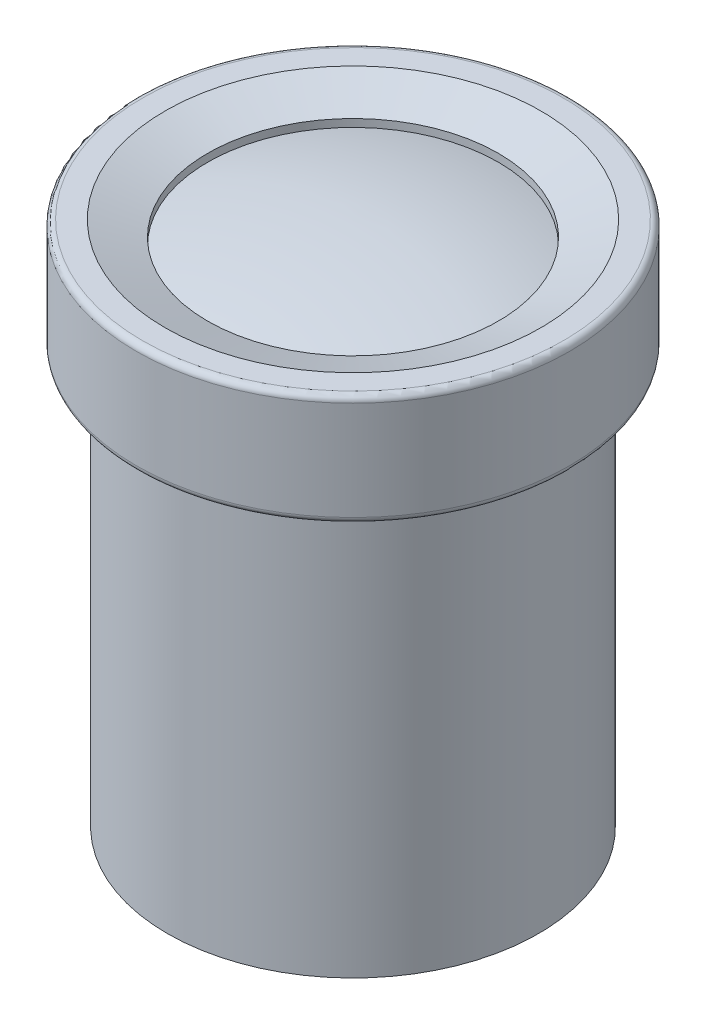
ISO-10303-21;
HEADER;
FILE_DESCRIPTION(('STEP AP214'),'2;1');
FILE_NAME('part.step','',(''),(''),'','','');
FILE_SCHEMA(('AUTOMOTIVE_DESIGN { 1 0 10303 214 1 1 1 1 }'));
ENDSEC;
DATA;
#1=APPLICATION_CONTEXT('core data for automotive mechanical design processes');
#2=APPLICATION_PROTOCOL_DEFINITION('international standard','automotive_design',2000,#1);
#3=PRODUCT_CONTEXT('',#1,'mechanical');
#4=PRODUCT('Part','Part','',(#3));
#5=PRODUCT_RELATED_PRODUCT_CATEGORY('part','',(#4));
#6=PRODUCT_DEFINITION_FORMATION('','',#4);
#7=PRODUCT_DEFINITION_CONTEXT('part definition',#1,'design');
#8=PRODUCT_DEFINITION('design','',#6,#7);
#9=PRODUCT_DEFINITION_SHAPE('','',#8);
#10=(LENGTH_UNIT() NAMED_UNIT(*) SI_UNIT(.MILLI.,.METRE.));
#11=(NAMED_UNIT(*) PLANE_ANGLE_UNIT() SI_UNIT($,.RADIAN.));
#12=(NAMED_UNIT(*) SI_UNIT($,.STERADIAN.) SOLID_ANGLE_UNIT());
#13=UNCERTAINTY_MEASURE_WITH_UNIT(LENGTH_MEASURE(1.E-05),#10,'distance_accuracy_value','');
#14=(GEOMETRIC_REPRESENTATION_CONTEXT(3) GLOBAL_UNCERTAINTY_ASSIGNED_CONTEXT((#13)) GLOBAL_UNIT_ASSIGNED_CONTEXT((#10,
#11,#12)) REPRESENTATION_CONTEXT('',''));
#15=CARTESIAN_POINT('',(0.,0.,0.));
#16=DIRECTION('',(0.,0.,1.));
#17=DIRECTION('',(1.,0.,0.));
#18=AXIS2_PLACEMENT_3D('',#15,#16,#17);
#19=CARTESIAN_POINT('',(0.,11.9701489185365,0.));
#20=DIRECTION('',(0.,1.,0.));
#21=DIRECTION('',(0.,0.,1.));
#22=AXIS2_PLACEMENT_3D('',#19,#20,#21);
#23=SPHERICAL_SURFACE('',#22,3.73794540429682);
#24=CARTESIAN_POINT('',(0.,14.2,0.));
#25=DIRECTION('',(0.,1.,0.));
#26=DIRECTION('',(0.,0.,1.));
#27=AXIS2_PLACEMENT_3D('',#24,#25,#26);
#28=CIRCLE('',#27,3.);
#29=CARTESIAN_POINT('',(0.,14.2,3.));
#30=VERTEX_POINT('',#29);
#31=EDGE_CURVE('E11',#30,#30,#28,.T.);
#32=ORIENTED_EDGE('',*,*,#31,.T.);
#33=EDGE_LOOP('',(#32));
#34=FACE_BOUND('',#33,.T.);
#35=ADVANCED_FACE('F43',(#34),#23,.T.);
#36=CARTESIAN_POINT('',(0.,16.9,0.));
#37=DIRECTION('',(0.,1.,0.));
#38=DIRECTION('',(0.,0.,1.));
#39=AXIS2_PLACEMENT_3D('',#36,#37,#38);
#40=CYLINDRICAL_SURFACE('',#39,3.);
#41=CARTESIAN_POINT('',(0.,13.8156890238422,0.));
#42=DIRECTION('',(0.,1.,0.));
#43=DIRECTION('',(0.,0.,1.));
#44=AXIS2_PLACEMENT_3D('',#41,#42,#43);
#45=CIRCLE('',#44,3.);
#46=CARTESIAN_POINT('',(0.,13.8156890238422,3.));
#47=VERTEX_POINT('',#46);
#48=EDGE_CURVE('E49',#47,#47,#45,.T.);
#49=ORIENTED_EDGE('',*,*,#48,.T.);
#50=EDGE_LOOP('',(#49));
#51=FACE_BOUND('',#50,.T.);
#52=ORIENTED_EDGE('',*,*,#31,.F.);
#53=EDGE_LOOP('',(#52));
#54=FACE_BOUND('',#53,.T.);
#55=ADVANCED_FACE('F55',(#51,#54),#40,.T.);
#56=CARTESIAN_POINT('',(0.,7.13675893047195,0.));
#57=DIRECTION('',(0.,1.,0.));
#58=DIRECTION('',(0.,0.,1.));
#59=AXIS2_PLACEMENT_3D('',#56,#57,#58);
#60=SPHERICAL_SURFACE('',#59,7.32175574518345);
#61=ORIENTED_EDGE('',*,*,#48,.F.);
#62=EDGE_LOOP('',(#61));
#63=FACE_BOUND('',#62,.T.);
#64=ADVANCED_FACE('F58',(#63),#60,.F.);
#65=CLOSED_SHELL('',(#35,#55,#64));
#66=MANIFOLD_SOLID_BREP('B2',#65);
#67=CARTESIAN_POINT('',(0.,11.7828372478995,0.));
#68=DIRECTION('',(0.,1.,0.));
#69=DIRECTION('',(0.,0.,1.));
#70=AXIS2_PLACEMENT_3D('',#67,#68,#69);
#71=SPHERICAL_SURFACE('',#70,1.5978795098539);
#72=CARTESIAN_POINT('',(0.,12.525571158927,0.));
#73=DIRECTION('',(0.,1.,0.));
#74=DIRECTION('',(0.,0.,1.));
#75=AXIS2_PLACEMENT_3D('',#72,#73,#74);
#76=CIRCLE('',#75,1.41476685903394);
#77=CARTESIAN_POINT('',(0.,12.525571158927,1.41476685903394));
#78=VERTEX_POINT('',#77);
#79=EDGE_CURVE('E42',#78,#78,#76,.T.);
#80=ORIENTED_EDGE('',*,*,#79,.T.);
#81=EDGE_LOOP('',(#80));
#82=FACE_BOUND('',#81,.T.);
#83=ADVANCED_FACE('F91',(#82),#71,.T.);
#84=CARTESIAN_POINT('',(0.,16.9,0.));
#85=DIRECTION('',(0.,1.,0.));
#86=DIRECTION('',(0.,0.,1.));
#87=AXIS2_PLACEMENT_3D('',#84,#85,#86);
#88=CYLINDRICAL_SURFACE('',#87,1.41476685903394);
#89=CARTESIAN_POINT('',(0.,11.9701489185365,0.));
#90=DIRECTION('',(0.,1.,0.));
#91=DIRECTION('',(0.,0.,1.));
#92=AXIS2_PLACEMENT_3D('',#89,#90,#91);
#93=CIRCLE('',#92,1.41476685903394);
#94=CARTESIAN_POINT('',(0.,11.9701489185365,1.41476685903394));
#95=VERTEX_POINT('',#94);
#96=EDGE_CURVE('E97',#95,#95,#93,.T.);
#97=ORIENTED_EDGE('',*,*,#96,.T.);
#98=EDGE_LOOP('',(#97));
#99=FACE_BOUND('',#98,.T.);
#100=ORIENTED_EDGE('',*,*,#79,.F.);
#101=EDGE_LOOP('',(#100));
#102=FACE_BOUND('',#101,.T.);
#103=ADVANCED_FACE('F103',(#99,#102),#88,.T.);
#104=CARTESIAN_POINT('',(0.,11.9701489185365,1.41476685903394));
#105=DIRECTION('',(0.,-1.,0.));
#106=DIRECTION('',(0.,0.,-1.));
#107=AXIS2_PLACEMENT_3D('',#104,#105,#106);
#108=PLANE('',#107);
#109=ORIENTED_EDGE('',*,*,#96,.F.);
#110=EDGE_LOOP('',(#109));
#111=FACE_BOUND('',#110,.T.);
#112=ADVANCED_FACE('F106',(#111),#108,.T.);
#113=CLOSED_SHELL('',(#83,#103,#112));
#114=MANIFOLD_SOLID_BREP('B6',#113);
#115=CARTESIAN_POINT('',(0.,0.,0.));
#116=DIRECTION('',(0.,-1.,0.));
#117=DIRECTION('',(0.,0.,-1.));
#118=AXIS2_PLACEMENT_3D('',#115,#116,#117);
#119=PLANE('',#118);
#120=CARTESIAN_POINT('',(0.,0.,0.));
#121=DIRECTION('',(0.,1.,0.));
#122=DIRECTION('',(0.,0.,1.));
#123=AXIS2_PLACEMENT_3D('',#120,#121,#122);
#124=CIRCLE('',#123,1.99999999999998);
#125=CARTESIAN_POINT('',(0.,0.,2.));
#126=VERTEX_POINT('',#125);
#127=EDGE_CURVE('E90',#126,#126,#124,.T.);
#128=ORIENTED_EDGE('',*,*,#127,.F.);
#129=EDGE_LOOP('',(#128));
#130=FACE_BOUND('',#129,.T.);
#131=ADVANCED_FACE('F139',(#130),#119,.T.);
#132=CARTESIAN_POINT('',(0.,16.9,0.));
#133=DIRECTION('',(0.,1.,0.));
#134=DIRECTION('',(0.,0.,1.));
#135=AXIS2_PLACEMENT_3D('',#132,#133,#134);
#136=CYLINDRICAL_SURFACE('',#135,1.99999999999998);
#137=ORIENTED_EDGE('',*,*,#127,.T.);
#138=EDGE_LOOP('',(#137));
#139=FACE_BOUND('',#138,.T.);
#140=CARTESIAN_POINT('',(0.,0.999999999999997,0.));
#141=DIRECTION('',(0.,1.,0.));
#142=DIRECTION('',(0.,0.,1.));
#143=AXIS2_PLACEMENT_3D('',#140,#141,#142);
#144=CIRCLE('',#143,1.99999999999998);
#145=CARTESIAN_POINT('',(0.,1.,2.));
#146=VERTEX_POINT('',#145);
#147=EDGE_CURVE('E145',#146,#146,#144,.T.);
#148=ORIENTED_EDGE('',*,*,#147,.F.);
#149=EDGE_LOOP('',(#148));
#150=FACE_BOUND('',#149,.T.);
#151=ADVANCED_FACE('F171',(#139,#150),#136,.T.);
#152=CARTESIAN_POINT('',(0.,0.999999999999998,2.));
#153=DIRECTION('',(0.,-1.,0.));
#154=DIRECTION('',(0.,0.,-1.));
#155=AXIS2_PLACEMENT_3D('',#152,#153,#154);
#156=PLANE('',#155);
#157=ORIENTED_EDGE('',*,*,#147,.T.);
#158=EDGE_LOOP('',(#157));
#159=FACE_BOUND('',#158,.T.);
#160=CARTESIAN_POINT('',(0.,0.99999999999999,0.));
#161=DIRECTION('',(0.,1.,0.));
#162=DIRECTION('',(0.,0.,1.));
#163=AXIS2_PLACEMENT_3D('',#160,#161,#162);
#164=CIRCLE('',#163,4.69999999999998);
#165=CARTESIAN_POINT('',(0.,0.999999999999996,4.7));
#166=VERTEX_POINT('',#165);
#167=EDGE_CURVE('E149',#166,#166,#164,.T.);
#168=ORIENTED_EDGE('',*,*,#167,.F.);
#169=EDGE_LOOP('',(#168));
#170=FACE_BOUND('',#169,.T.);
#171=ADVANCED_FACE('F163',(#159,#170),#156,.T.);
#172=CARTESIAN_POINT('',(0.,16.9,0.));
#173=DIRECTION('',(0.,1.,0.));
#174=DIRECTION('',(0.,0.,1.));
#175=AXIS2_PLACEMENT_3D('',#172,#173,#174);
#176=CYLINDRICAL_SURFACE('',#175,4.69999999999998);
#177=ORIENTED_EDGE('',*,*,#167,.T.);
#178=EDGE_LOOP('',(#177));
#179=FACE_BOUND('',#178,.T.);
#180=CARTESIAN_POINT('',(0.,1.99999999999999,0.));
#181=DIRECTION('',(0.,1.,0.));
#182=DIRECTION('',(0.,0.,1.));
#183=AXIS2_PLACEMENT_3D('',#180,#181,#182);
#184=CIRCLE('',#183,4.69999999999998);
#185=CARTESIAN_POINT('',(0.,2.,4.7));
#186=VERTEX_POINT('',#185);
#187=EDGE_CURVE('E153',#186,#186,#184,.T.);
#188=ORIENTED_EDGE('',*,*,#187,.F.);
#189=EDGE_LOOP('',(#188));
#190=FACE_BOUND('',#189,.T.);
#191=ADVANCED_FACE('F161',(#179,#190),#176,.T.);
#192=CARTESIAN_POINT('',(0.,2.,4.7));
#193=DIRECTION('',(0.,1.,0.));
#194=DIRECTION('',(0.,0.,1.));
#195=AXIS2_PLACEMENT_3D('',#192,#193,#194);
#196=PLANE('',#195);
#197=ORIENTED_EDGE('',*,*,#187,.T.);
#198=EDGE_LOOP('',(#197));
#199=FACE_BOUND('',#198,.T.);
#200=ADVANCED_FACE('F159',(#199),#196,.T.);
#201=CLOSED_SHELL('',(#131,#151,#171,#191,#200));
#202=MANIFOLD_SOLID_BREP('B37',#201);
#203=CARTESIAN_POINT('',(0.,-0.417307692307675,0.));
#204=DIRECTION('',(0.,1.,0.));
#205=DIRECTION('',(0.,0.,1.));
#206=AXIS2_PLACEMENT_3D('',#203,#204,#205);
#207=SPHERICAL_SURFACE('',#206,17.3173076923077);
#208=CARTESIAN_POINT('',(0.,16.25,0.));
#209=DIRECTION('',(0.,1.,0.));
#210=DIRECTION('',(0.,0.,1.));
#211=AXIS2_PLACEMENT_3D('',#208,#209,#210);
#212=CIRCLE('',#211,4.7);
#213=CARTESIAN_POINT('',(0.,16.25,4.7));
#214=VERTEX_POINT('',#213);
#215=EDGE_CURVE('E138',#214,#214,#212,.T.);
#216=ORIENTED_EDGE('',*,*,#215,.T.);
#217=EDGE_LOOP('',(#216));
#218=FACE_BOUND('',#217,.T.);
#219=ADVANCED_FACE('F216',(#218),#207,.T.);
#220=CARTESIAN_POINT('',(0.,16.9,0.));
#221=DIRECTION('',(0.,1.,0.));
#222=DIRECTION('',(0.,0.,1.));
#223=AXIS2_PLACEMENT_3D('',#220,#221,#222);
#224=CYLINDRICAL_SURFACE('',#223,4.7);
#225=CARTESIAN_POINT('',(0.,15.25,0.));
#226=DIRECTION('',(0.,1.,0.));
#227=DIRECTION('',(0.,0.,1.));
#228=AXIS2_PLACEMENT_3D('',#225,#226,#227);
#229=CIRCLE('',#228,4.7);
#230=CARTESIAN_POINT('',(0.,15.25,4.7));
#231=VERTEX_POINT('',#230);
#232=EDGE_CURVE('E222',#231,#231,#229,.T.);
#233=ORIENTED_EDGE('',*,*,#232,.T.);
#234=EDGE_LOOP('',(#233));
#235=FACE_BOUND('',#234,.T.);
#236=ORIENTED_EDGE('',*,*,#215,.F.);
#237=EDGE_LOOP('',(#236));
#238=FACE_BOUND('',#237,.T.);
#239=ADVANCED_FACE('F228',(#235,#238),#224,.T.);
#240=CARTESIAN_POINT('',(0.,-1.41730769230768,0.));
#241=DIRECTION('',(0.,1.,0.));
#242=DIRECTION('',(0.,0.,1.));
#243=AXIS2_PLACEMENT_3D('',#240,#241,#242);
#244=SPHERICAL_SURFACE('',#243,17.3173076923077);
#245=ORIENTED_EDGE('',*,*,#232,.F.);
#246=EDGE_LOOP('',(#245));
#247=FACE_BOUND('',#246,.T.);
#248=ADVANCED_FACE('F231',(#247),#244,.F.);
#249=CLOSED_SHELL('',(#219,#239,#248));
#250=MANIFOLD_SOLID_BREP('B85',#249);
#251=CARTESIAN_POINT('',(0.,17.,7.));
#252=DIRECTION('',(0.,1.,0.));
#253=DIRECTION('',(0.,0.,1.));
#254=AXIS2_PLACEMENT_3D('',#251,#252,#253);
#255=PLANE('',#254);
#256=CARTESIAN_POINT('',(0.,17.,0.));
#257=DIRECTION('',(0.,1.,0.));
#258=DIRECTION('',(0.,0.,1.));
#259=AXIS2_PLACEMENT_3D('',#256,#257,#258);
#260=CIRCLE('',#259,6.8);
#261=CARTESIAN_POINT('',(0.,17.,6.8));
#262=VERTEX_POINT('',#261);
#263=EDGE_CURVE('E215',#262,#262,#260,.T.);
#264=ORIENTED_EDGE('',*,*,#263,.T.);
#265=EDGE_LOOP('',(#264));
#266=FACE_BOUND('',#265,.T.);
#267=CARTESIAN_POINT('',(0.,17.,0.));
#268=DIRECTION('',(0.,1.,0.));
#269=DIRECTION('',(0.,0.,1.));
#270=AXIS2_PLACEMENT_3D('',#267,#268,#269);
#271=CIRCLE('',#270,6.07373870972733);
#272=CARTESIAN_POINT('',(0.,17.,6.07373870972733));
#273=VERTEX_POINT('',#272);
#274=EDGE_CURVE('E315',#273,#273,#271,.T.);
#275=ORIENTED_EDGE('',*,*,#274,.F.);
#276=EDGE_LOOP('',(#275));
#277=FACE_BOUND('',#276,.T.);
#278=ADVANCED_FACE('F256',(#266,#277),#255,.T.);
#279=CARTESIAN_POINT('',(0.,20.6365129619379,0.));
#280=DIRECTION('',(0.,1.,0.));
#281=DIRECTION('',(0.,0.,1.));
#282=AXIS2_PLACEMENT_3D('',#279,#280,#281);
#283=CYLINDRICAL_SURFACE('',#282,7.);
#284=CARTESIAN_POINT('',(0.,13.6,0.));
#285=DIRECTION('',(0.,-1.,0.));
#286=DIRECTION('',(0.,0.,-1.));
#287=AXIS2_PLACEMENT_3D('',#284,#285,#286);
#288=CIRCLE('',#287,7.);
#289=CARTESIAN_POINT('',(0.,13.6,-7.));
#290=VERTEX_POINT('',#289);
#291=EDGE_CURVE('E267',#290,#290,#288,.F.);
#292=ORIENTED_EDGE('',*,*,#291,.T.);
#293=EDGE_LOOP('',(#292));
#294=FACE_BOUND('',#293,.T.);
#295=CARTESIAN_POINT('',(0.,16.8,0.));
#296=DIRECTION('',(0.,1.,0.));
#297=DIRECTION('',(0.,0.,1.));
#298=AXIS2_PLACEMENT_3D('',#295,#296,#297);
#299=CIRCLE('',#298,7.);
#300=CARTESIAN_POINT('',(0.,16.8,7.));
#301=VERTEX_POINT('',#300);
#302=EDGE_CURVE('E271',#301,#301,#299,.F.);
#303=ORIENTED_EDGE('',*,*,#302,.T.);
#304=EDGE_LOOP('',(#303));
#305=FACE_BOUND('',#304,.T.);
#306=ADVANCED_FACE('F323',(#294,#305),#283,.T.);
#307=CARTESIAN_POINT('',(0.,13.4,6.));
#308=DIRECTION('',(0.,-1.,0.));
#309=DIRECTION('',(0.,0.,-1.));
#310=AXIS2_PLACEMENT_3D('',#307,#308,#309);
#311=PLANE('',#310);
#312=CARTESIAN_POINT('',(0.,13.4,0.));
#313=DIRECTION('',(0.,-1.,0.));
#314=DIRECTION('',(0.,0.,-1.));
#315=AXIS2_PLACEMENT_3D('',#312,#313,#314);
#316=CIRCLE('',#315,6.8);
#317=CARTESIAN_POINT('',(0.,13.4,-6.8));
#318=VERTEX_POINT('',#317);
#319=EDGE_CURVE('E263',#318,#318,#316,.T.);
#320=ORIENTED_EDGE('',*,*,#319,.T.);
#321=EDGE_LOOP('',(#320));
#322=FACE_BOUND('',#321,.T.);
#323=CARTESIAN_POINT('',(0.,13.4,0.));
#324=DIRECTION('',(0.,1.,0.));
#325=DIRECTION('',(0.,0.,1.));
#326=AXIS2_PLACEMENT_3D('',#323,#324,#325);
#327=CIRCLE('',#326,6.);
#328=CARTESIAN_POINT('',(0.,13.4,6.));
#329=VERTEX_POINT('',#328);
#330=EDGE_CURVE('E282',#329,#329,#327,.T.);
#331=ORIENTED_EDGE('',*,*,#330,.T.);
#332=EDGE_LOOP('',(#331));
#333=FACE_BOUND('',#332,.T.);
#334=ADVANCED_FACE('F328',(#322,#333),#311,.T.);
#335=CARTESIAN_POINT('',(0.,20.6365129619379,0.));
#336=DIRECTION('',(0.,1.,0.));
#337=DIRECTION('',(0.,0.,1.));
#338=AXIS2_PLACEMENT_3D('',#335,#336,#337);
#339=CYLINDRICAL_SURFACE('',#338,5.99999999999999);
#340=CARTESIAN_POINT('',(0.,0.,0.));
#341=DIRECTION('',(0.,1.,0.));
#342=DIRECTION('',(0.,0.,1.));
#343=AXIS2_PLACEMENT_3D('',#340,#341,#342);
#344=CIRCLE('',#343,5.99999999999999);
#345=CARTESIAN_POINT('',(0.,0.,5.99999999999999));
#346=VERTEX_POINT('',#345);
#347=EDGE_CURVE('E285',#346,#346,#344,.T.);
#348=ORIENTED_EDGE('',*,*,#347,.T.);
#349=EDGE_LOOP('',(#348));
#350=FACE_BOUND('',#349,.T.);
#351=ORIENTED_EDGE('',*,*,#330,.F.);
#352=EDGE_LOOP('',(#351));
#353=FACE_BOUND('',#352,.T.);
#354=ADVANCED_FACE('F364',(#350,#353),#339,.T.);
#355=CARTESIAN_POINT('',(0.,0.,2.));
#356=DIRECTION('',(0.,-1.,0.));
#357=DIRECTION('',(0.,0.,-1.));
#358=AXIS2_PLACEMENT_3D('',#355,#356,#357);
#359=PLANE('',#358);
#360=CARTESIAN_POINT('',(0.,0.,0.));
#361=DIRECTION('',(0.,1.,0.));
#362=DIRECTION('',(0.,0.,1.));
#363=AXIS2_PLACEMENT_3D('',#360,#361,#362);
#364=CIRCLE('',#363,2.);
#365=CARTESIAN_POINT('',(0.,0.,2.));
#366=VERTEX_POINT('',#365);
#367=EDGE_CURVE('E288',#366,#366,#364,.T.);
#368=ORIENTED_EDGE('',*,*,#367,.T.);
#369=EDGE_LOOP('',(#368));
#370=FACE_BOUND('',#369,.T.);
#371=ORIENTED_EDGE('',*,*,#347,.F.);
#372=EDGE_LOOP('',(#371));
#373=FACE_BOUND('',#372,.T.);
#374=ADVANCED_FACE('F478',(#370,#373),#359,.T.);
#375=CARTESIAN_POINT('',(0.,20.6365129619379,0.));
#376=DIRECTION('',(0.,1.,0.));
#377=DIRECTION('',(0.,0.,1.));
#378=AXIS2_PLACEMENT_3D('',#375,#376,#377);
#379=CYLINDRICAL_SURFACE('',#378,2.);
#380=CARTESIAN_POINT('',(0.,1.,0.));
#381=DIRECTION('',(0.,1.,0.));
#382=DIRECTION('',(0.,0.,1.));
#383=AXIS2_PLACEMENT_3D('',#380,#381,#382);
#384=CIRCLE('',#383,2.);
#385=CARTESIAN_POINT('',(0.,1.,2.));
#386=VERTEX_POINT('',#385);
#387=EDGE_CURVE('E291',#386,#386,#384,.T.);
#388=ORIENTED_EDGE('',*,*,#387,.T.);
#389=EDGE_LOOP('',(#388));
#390=FACE_BOUND('',#389,.T.);
#391=ORIENTED_EDGE('',*,*,#367,.F.);
#392=EDGE_LOOP('',(#391));
#393=FACE_BOUND('',#392,.T.);
#394=ADVANCED_FACE('F468',(#390,#393),#379,.F.);
#395=CARTESIAN_POINT('',(0.,1.,2.));
#396=DIRECTION('',(0.,1.,0.));
#397=DIRECTION('',(0.,0.,1.));
#398=AXIS2_PLACEMENT_3D('',#395,#396,#397);
#399=PLANE('',#398);
#400=CARTESIAN_POINT('',(0.,1.,0.));
#401=DIRECTION('',(0.,1.,0.));
#402=DIRECTION('',(0.,0.,1.));
#403=AXIS2_PLACEMENT_3D('',#400,#401,#402);
#404=CIRCLE('',#403,4.7);
#405=CARTESIAN_POINT('',(0.,1.,4.7));
#406=VERTEX_POINT('',#405);
#407=EDGE_CURVE('E294',#406,#406,#404,.T.);
#408=ORIENTED_EDGE('',*,*,#407,.T.);
#409=EDGE_LOOP('',(#408));
#410=FACE_BOUND('',#409,.T.);
#411=ORIENTED_EDGE('',*,*,#387,.F.);
#412=EDGE_LOOP('',(#411));
#413=FACE_BOUND('',#412,.T.);
#414=ADVANCED_FACE('F458',(#410,#413),#399,.T.);
#415=CARTESIAN_POINT('',(0.,20.6365129619379,0.));
#416=DIRECTION('',(0.,1.,0.));
#417=DIRECTION('',(0.,0.,1.));
#418=AXIS2_PLACEMENT_3D('',#415,#416,#417);
#419=CYLINDRICAL_SURFACE('',#418,4.7);
#420=CARTESIAN_POINT('',(0.,11.5,0.));
#421=DIRECTION('',(0.,1.,0.));
#422=DIRECTION('',(0.,0.,1.));
#423=AXIS2_PLACEMENT_3D('',#420,#421,#422);
#424=CIRCLE('',#423,4.7);
#425=CARTESIAN_POINT('',(0.,11.5,4.7));
#426=VERTEX_POINT('',#425);
#427=EDGE_CURVE('E297',#426,#426,#424,.T.);
#428=ORIENTED_EDGE('',*,*,#427,.T.);
#429=EDGE_LOOP('',(#428));
#430=FACE_BOUND('',#429,.T.);
#431=ORIENTED_EDGE('',*,*,#407,.F.);
#432=EDGE_LOOP('',(#431));
#433=FACE_BOUND('',#432,.T.);
#434=ADVANCED_FACE('F448',(#430,#433),#419,.F.);
#435=CARTESIAN_POINT('',(0.,11.5,1.41476685903394));
#436=DIRECTION('',(0.,-1.,0.));
#437=DIRECTION('',(0.,0.,-1.));
#438=AXIS2_PLACEMENT_3D('',#435,#436,#437);
#439=PLANE('',#438);
#440=CARTESIAN_POINT('',(0.,11.5,0.));
#441=DIRECTION('',(0.,1.,0.));
#442=DIRECTION('',(0.,0.,1.));
#443=AXIS2_PLACEMENT_3D('',#440,#441,#442);
#444=CIRCLE('',#443,1.41476685903394);
#445=CARTESIAN_POINT('',(0.,11.5,1.41476685903394));
#446=VERTEX_POINT('',#445);
#447=EDGE_CURVE('E300',#446,#446,#444,.T.);
#448=ORIENTED_EDGE('',*,*,#447,.T.);
#449=EDGE_LOOP('',(#448));
#450=FACE_BOUND('',#449,.T.);
#451=ORIENTED_EDGE('',*,*,#427,.F.);
#452=EDGE_LOOP('',(#451));
#453=FACE_BOUND('',#452,.T.);
#454=ADVANCED_FACE('F438',(#450,#453),#439,.T.);
#455=CARTESIAN_POINT('',(0.,20.6365129619379,0.));
#456=DIRECTION('',(0.,1.,0.));
#457=DIRECTION('',(0.,0.,1.));
#458=AXIS2_PLACEMENT_3D('',#455,#456,#457);
#459=CYLINDRICAL_SURFACE('',#458,1.41476685903394);
#460=CARTESIAN_POINT('',(0.,12.8184413887343,0.));
#461=DIRECTION('',(0.,1.,0.));
#462=DIRECTION('',(0.,0.,1.));
#463=AXIS2_PLACEMENT_3D('',#460,#461,#462);
#464=CIRCLE('',#463,1.41476685903394);
#465=CARTESIAN_POINT('',(0.,12.8184413887343,1.41476685903394));
#466=VERTEX_POINT('',#465);
#467=EDGE_CURVE('E303',#466,#466,#464,.T.);
#468=ORIENTED_EDGE('',*,*,#467,.T.);
#469=EDGE_LOOP('',(#468));
#470=FACE_BOUND('',#469,.T.);
#471=ORIENTED_EDGE('',*,*,#447,.F.);
#472=EDGE_LOOP('',(#471));
#473=FACE_BOUND('',#472,.T.);
#474=ADVANCED_FACE('F428',(#470,#473),#459,.F.);
#475=CARTESIAN_POINT('',(0.,12.8184413887343,0.));
#476=DIRECTION('',(0.,1.,0.));
#477=DIRECTION('',(0.,0.,1.));
#478=AXIS2_PLACEMENT_3D('',#475,#476,#477);
#479=CONICAL_SURFACE('',#478,1.41476685903394,1.10317219166356);
#480=CARTESIAN_POINT('',(0.,13.6189533502077,0.));
#481=DIRECTION('',(0.,1.,0.));
#482=DIRECTION('',(0.,0.,1.));
#483=AXIS2_PLACEMENT_3D('',#480,#481,#482);
#484=CIRCLE('',#483,3.);
#485=CARTESIAN_POINT('',(0.,13.6189533502077,3.));
#486=VERTEX_POINT('',#485);
#487=EDGE_CURVE('E306',#486,#486,#484,.T.);
#488=ORIENTED_EDGE('',*,*,#487,.T.);
#489=EDGE_LOOP('',(#488));
#490=FACE_BOUND('',#489,.T.);
#491=ORIENTED_EDGE('',*,*,#467,.F.);
#492=EDGE_LOOP('',(#491));
#493=FACE_BOUND('',#492,.T.);
#494=ADVANCED_FACE('F405',(#490,#493),#479,.F.);
#495=CARTESIAN_POINT('',(0.,20.6365129619379,0.));
#496=DIRECTION('',(0.,1.,0.));
#497=DIRECTION('',(0.,0.,1.));
#498=AXIS2_PLACEMENT_3D('',#495,#496,#497);
#499=CYLINDRICAL_SURFACE('',#498,3.);
#500=CARTESIAN_POINT('',(0.,14.3,0.));
#501=DIRECTION('',(0.,1.,0.));
#502=DIRECTION('',(0.,0.,1.));
#503=AXIS2_PLACEMENT_3D('',#500,#501,#502);
#504=CIRCLE('',#503,3.);
#505=CARTESIAN_POINT('',(0.,14.3,3.));
#506=VERTEX_POINT('',#505);
#507=EDGE_CURVE('E279',#506,#506,#504,.T.);
#508=ORIENTED_EDGE('',*,*,#507,.T.);
#509=EDGE_LOOP('',(#508));
#510=FACE_BOUND('',#509,.T.);
#511=ORIENTED_EDGE('',*,*,#487,.F.);
#512=EDGE_LOOP('',(#511));
#513=FACE_BOUND('',#512,.T.);
#514=ADVANCED_FACE('F393',(#510,#513),#499,.F.);
#515=CARTESIAN_POINT('',(0.,14.5,4.7));
#516=DIRECTION('',(0.,1.,0.));
#517=DIRECTION('',(0.,0.,1.));
#518=AXIS2_PLACEMENT_3D('',#515,#516,#517);
#519=PLANE('',#518);
#520=CARTESIAN_POINT('',(0.,14.5,0.));
#521=DIRECTION('',(0.,1.,0.));
#522=DIRECTION('',(0.,0.,1.));
#523=AXIS2_PLACEMENT_3D('',#520,#521,#522);
#524=CIRCLE('',#523,3.2);
#525=CARTESIAN_POINT('',(0.,14.5,3.2));
#526=VERTEX_POINT('',#525);
#527=EDGE_CURVE('E276',#526,#526,#524,.F.);
#528=ORIENTED_EDGE('',*,*,#527,.T.);
#529=EDGE_LOOP('',(#528));
#530=FACE_BOUND('',#529,.T.);
#531=CARTESIAN_POINT('',(0.,14.5,0.));
#532=DIRECTION('',(0.,1.,0.));
#533=DIRECTION('',(0.,0.,1.));
#534=AXIS2_PLACEMENT_3D('',#531,#532,#533);
#535=CIRCLE('',#534,4.7);
#536=CARTESIAN_POINT('',(0.,14.5,4.7));
#537=VERTEX_POINT('',#536);
#538=EDGE_CURVE('E309',#537,#537,#535,.T.);
#539=ORIENTED_EDGE('',*,*,#538,.T.);
#540=EDGE_LOOP('',(#539));
#541=FACE_BOUND('',#540,.T.);
#542=ADVANCED_FACE('F387',(#530,#541),#519,.T.);
#543=CARTESIAN_POINT('',(0.,20.6365129619379,0.));
#544=DIRECTION('',(0.,1.,0.));
#545=DIRECTION('',(0.,0.,1.));
#546=AXIS2_PLACEMENT_3D('',#543,#544,#545);
#547=CYLINDRICAL_SURFACE('',#546,4.7);
#548=CARTESIAN_POINT('',(0.,16.5,0.));
#549=DIRECTION('',(0.,1.,0.));
#550=DIRECTION('',(0.,0.,1.));
#551=AXIS2_PLACEMENT_3D('',#548,#549,#550);
#552=CIRCLE('',#551,4.7);
#553=CARTESIAN_POINT('',(0.,16.5,4.7));
#554=VERTEX_POINT('',#553);
#555=EDGE_CURVE('E312',#554,#554,#552,.T.);
#556=ORIENTED_EDGE('',*,*,#555,.T.);
#557=EDGE_LOOP('',(#556));
#558=FACE_BOUND('',#557,.T.);
#559=ORIENTED_EDGE('',*,*,#538,.F.);
#560=EDGE_LOOP('',(#559));
#561=FACE_BOUND('',#560,.T.);
#562=ADVANCED_FACE('F392',(#558,#561),#547,.F.);
#563=CARTESIAN_POINT('',(0.,16.5,0.));
#564=DIRECTION('',(0.,1.,0.));
#565=DIRECTION('',(0.,0.,1.));
#566=AXIS2_PLACEMENT_3D('',#563,#564,#565);
#567=CONICAL_SURFACE('',#566,4.7,1.22173047639604);
#568=ORIENTED_EDGE('',*,*,#274,.T.);
#569=EDGE_LOOP('',(#568));
#570=FACE_BOUND('',#569,.T.);
#571=ORIENTED_EDGE('',*,*,#555,.F.);
#572=EDGE_LOOP('',(#571));
#573=FACE_BOUND('',#572,.T.);
#574=ADVANCED_FACE('F319',(#570,#573),#567,.F.);
#575=CARTESIAN_POINT('',(0.,14.3,0.));
#576=DIRECTION('',(0.,1.,0.));
#577=DIRECTION('',(0.,0.,1.));
#578=AXIS2_PLACEMENT_3D('',#575,#576,#577);
#579=TOROIDAL_SURFACE('',#578,3.2,0.2);
#580=ORIENTED_EDGE('',*,*,#527,.F.);
#581=EDGE_LOOP('',(#580));
#582=FACE_BOUND('',#581,.T.);
#583=ORIENTED_EDGE('',*,*,#507,.F.);
#584=EDGE_LOOP('',(#583));
#585=FACE_BOUND('',#584,.T.);
#586=ADVANCED_FACE('F333',(#582,#585),#579,.T.);
#587=CARTESIAN_POINT('',(0.,13.6,0.));
#588=DIRECTION('',(0.,-1.,0.));
#589=DIRECTION('',(0.,0.,-1.));
#590=AXIS2_PLACEMENT_3D('',#587,#588,#589);
#591=TOROIDAL_SURFACE('',#590,6.8,0.2);
#592=ORIENTED_EDGE('',*,*,#319,.F.);
#593=EDGE_LOOP('',(#592));
#594=FACE_BOUND('',#593,.T.);
#595=ORIENTED_EDGE('',*,*,#291,.F.);
#596=EDGE_LOOP('',(#595));
#597=FACE_BOUND('',#596,.T.);
#598=ADVANCED_FACE('F335',(#594,#597),#591,.T.);
#599=CARTESIAN_POINT('',(0.,16.8,0.));
#600=DIRECTION('',(0.,1.,0.));
#601=DIRECTION('',(0.,0.,1.));
#602=AXIS2_PLACEMENT_3D('',#599,#600,#601);
#603=TOROIDAL_SURFACE('',#602,6.8,0.2);
#604=ORIENTED_EDGE('',*,*,#302,.F.);
#605=EDGE_LOOP('',(#604));
#606=FACE_BOUND('',#605,.T.);
#607=ORIENTED_EDGE('',*,*,#263,.F.);
#608=EDGE_LOOP('',(#607));
#609=FACE_BOUND('',#608,.T.);
#610=ADVANCED_FACE('F258',(#606,#609),#603,.T.);
#611=CLOSED_SHELL('',(#278,#306,#334,#354,#374,#394,#414,#434,#454,#474,#494,#514,#542,#562,
#574,#586,#598,#610));
#612=MANIFOLD_SOLID_BREP('B133',#611);
#613=ADVANCED_BREP_SHAPE_REPRESENTATION('',(#18,#66,#114,#202,#250,#612),#14);
#614=SHAPE_DEFINITION_REPRESENTATION(#9,#613);
ENDSEC;
END-ISO-10303-21;
